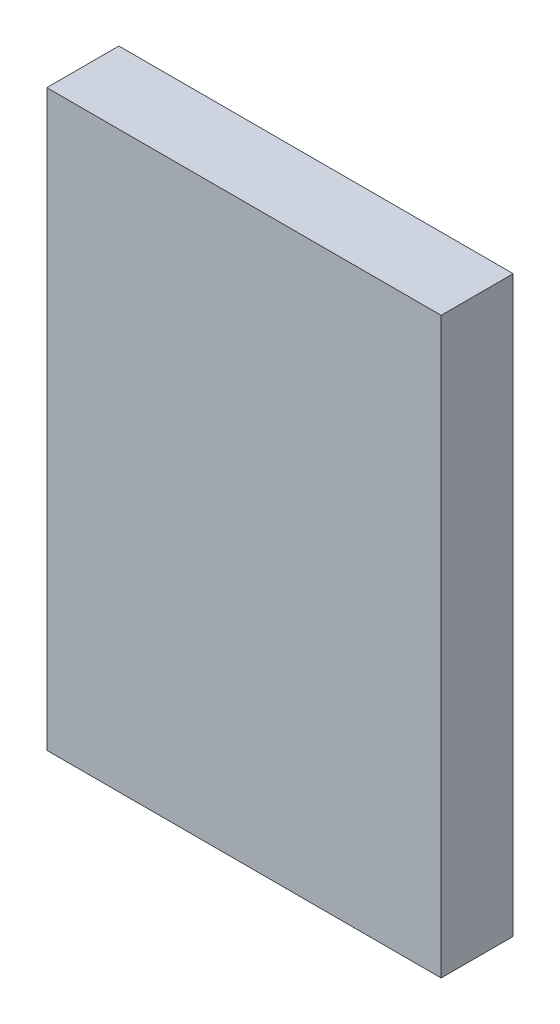
ISO-10303-21;
HEADER;
FILE_DESCRIPTION(('STEP AP214'),'2;1');
FILE_NAME('part.step','',(''),(''),'','','');
FILE_SCHEMA(('AUTOMOTIVE_DESIGN { 1 0 10303 214 1 1 1 1 }'));
ENDSEC;
DATA;
#1=APPLICATION_CONTEXT('core data for automotive mechanical design processes');
#2=APPLICATION_PROTOCOL_DEFINITION('international standard','automotive_design',2000,#1);
#3=PRODUCT_CONTEXT('',#1,'mechanical');
#4=PRODUCT('Part','Part','',(#3));
#5=PRODUCT_RELATED_PRODUCT_CATEGORY('part','',(#4));
#6=PRODUCT_DEFINITION_FORMATION('','',#4);
#7=PRODUCT_DEFINITION_CONTEXT('part definition',#1,'design');
#8=PRODUCT_DEFINITION('design','',#6,#7);
#9=PRODUCT_DEFINITION_SHAPE('','',#8);
#10=(LENGTH_UNIT() NAMED_UNIT(*) SI_UNIT(.MILLI.,.METRE.));
#11=(NAMED_UNIT(*) PLANE_ANGLE_UNIT() SI_UNIT($,.RADIAN.));
#12=(NAMED_UNIT(*) SI_UNIT($,.STERADIAN.) SOLID_ANGLE_UNIT());
#13=UNCERTAINTY_MEASURE_WITH_UNIT(LENGTH_MEASURE(1.E-05),#10,'distance_accuracy_value','');
#14=(GEOMETRIC_REPRESENTATION_CONTEXT(3) GLOBAL_UNCERTAINTY_ASSIGNED_CONTEXT((#13)) GLOBAL_UNIT_ASSIGNED_CONTEXT((#10,
#11,#12)) REPRESENTATION_CONTEXT('',''));
#15=CARTESIAN_POINT('',(0.,0.,0.));
#16=DIRECTION('',(0.,0.,1.));
#17=DIRECTION('',(1.,0.,0.));
#18=AXIS2_PLACEMENT_3D('',#15,#16,#17);
#19=CARTESIAN_POINT('',(-0.597,-1.549,0.));
#20=DIRECTION('',(0.,-1.,0.));
#21=DIRECTION('',(0.,0.,-1.));
#22=AXIS2_PLACEMENT_3D('',#19,#20,#21);
#23=PLANE('',#22);
#24=DIRECTION('',(-1.,0.,0.));
#25=VECTOR('',#24,1.);
#26=CARTESIAN_POINT('',(-0.318,-1.549,0.));
#27=LINE('',#26,#25);
#28=CARTESIAN_POINT('',(-0.318,-1.549,0.));
#29=VERTEX_POINT('',#28);
#30=CARTESIAN_POINT('',(-0.597,-1.549,0.));
#31=VERTEX_POINT('',#30);
#32=EDGE_CURVE('E11',#29,#31,#27,.T.);
#33=ORIENTED_EDGE('',*,*,#32,.F.);
#34=DIRECTION('',(0.,0.,-1.));
#35=VECTOR('',#34,1.);
#36=CARTESIAN_POINT('',(-0.318,-1.549,0.051));
#37=LINE('',#36,#35);
#38=CARTESIAN_POINT('',(-0.318,-1.549,0.051));
#39=VERTEX_POINT('',#38);
#40=EDGE_CURVE('E24',#39,#29,#37,.T.);
#41=ORIENTED_EDGE('',*,*,#40,.F.);
#42=DIRECTION('',(1.,0.,0.));
#43=VECTOR('',#42,1.);
#44=CARTESIAN_POINT('',(-0.597,-1.549,0.051));
#45=LINE('',#44,#43);
#46=CARTESIAN_POINT('',(-0.597,-1.549,0.051));
#47=VERTEX_POINT('',#46);
#48=EDGE_CURVE('E88',#47,#39,#45,.T.);
#49=ORIENTED_EDGE('',*,*,#48,.F.);
#50=DIRECTION('',(0.,0.,1.));
#51=VECTOR('',#50,1.);
#52=CARTESIAN_POINT('',(-0.597,-1.549,0.));
#53=LINE('',#52,#51);
#54=EDGE_CURVE('E77',#31,#47,#53,.T.);
#55=ORIENTED_EDGE('',*,*,#54,.F.);
#56=EDGE_LOOP('',(#33,#41,#49,#55));
#57=FACE_BOUND('',#56,.T.);
#58=ADVANCED_FACE('F17',(#57),#23,.T.);
#59=CARTESIAN_POINT('',(-0.318,-1.549,0.));
#60=DIRECTION('',(1.,0.,0.));
#61=DIRECTION('',(0.,1.,0.));
#62=AXIS2_PLACEMENT_3D('',#59,#60,#61);
#63=PLANE('',#62);
#64=DIRECTION('',(0.,-1.,0.));
#65=VECTOR('',#64,1.);
#66=CARTESIAN_POINT('',(-0.318,-1.143,0.));
#67=LINE('',#66,#65);
#68=CARTESIAN_POINT('',(-0.318,-1.143,0.));
#69=VERTEX_POINT('',#68);
#70=EDGE_CURVE('E85',#69,#29,#67,.T.);
#71=ORIENTED_EDGE('',*,*,#70,.F.);
#72=DIRECTION('',(0.,0.,-1.));
#73=VECTOR('',#72,1.);
#74=CARTESIAN_POINT('',(-0.318,-1.143,0.051));
#75=LINE('',#74,#73);
#76=CARTESIAN_POINT('',(-0.318,-1.143,0.051));
#77=VERTEX_POINT('',#76);
#78=EDGE_CURVE('E83',#77,#69,#75,.T.);
#79=ORIENTED_EDGE('',*,*,#78,.F.);
#80=DIRECTION('',(0.,1.,0.));
#81=VECTOR('',#80,1.);
#82=CARTESIAN_POINT('',(-0.318,-1.549,0.051));
#83=LINE('',#82,#81);
#84=EDGE_CURVE('E72',#39,#77,#83,.T.);
#85=ORIENTED_EDGE('',*,*,#84,.F.);
#86=ORIENTED_EDGE('',*,*,#40,.T.);
#87=EDGE_LOOP('',(#71,#79,#85,#86));
#88=FACE_BOUND('',#87,.T.);
#89=ADVANCED_FACE('F90',(#88),#63,.T.);
#90=CARTESIAN_POINT('',(-0.318,-1.143,0.));
#91=DIRECTION('',(0.,1.,0.));
#92=DIRECTION('',(1.,0.,0.));
#93=AXIS2_PLACEMENT_3D('',#90,#91,#92);
#94=PLANE('',#93);
#95=DIRECTION('',(1.,0.,0.));
#96=VECTOR('',#95,1.);
#97=CARTESIAN_POINT('',(-0.597,-1.143,0.));
#98=LINE('',#97,#96);
#99=CARTESIAN_POINT('',(-0.597,-1.143,0.));
#100=VERTEX_POINT('',#99);
#101=EDGE_CURVE('E60',#100,#69,#98,.T.);
#102=ORIENTED_EDGE('',*,*,#101,.F.);
#103=DIRECTION('',(0.,0.,-1.));
#104=VECTOR('',#103,1.);
#105=CARTESIAN_POINT('',(-0.597,-1.143,0.051));
#106=LINE('',#105,#104);
#107=CARTESIAN_POINT('',(-0.597,-1.143,0.051));
#108=VERTEX_POINT('',#107);
#109=EDGE_CURVE('E54',#108,#100,#106,.T.);
#110=ORIENTED_EDGE('',*,*,#109,.F.);
#111=DIRECTION('',(-1.,0.,0.));
#112=VECTOR('',#111,1.);
#113=CARTESIAN_POINT('',(-0.318,-1.143,0.051));
#114=LINE('',#113,#112);
#115=EDGE_CURVE('E58',#77,#108,#114,.T.);
#116=ORIENTED_EDGE('',*,*,#115,.F.);
#117=ORIENTED_EDGE('',*,*,#78,.T.);
#118=EDGE_LOOP('',(#102,#110,#116,#117));
#119=FACE_BOUND('',#118,.T.);
#120=ADVANCED_FACE('F56',(#119),#94,.T.);
#121=CARTESIAN_POINT('',(-0.597,-1.143,0.));
#122=DIRECTION('',(-1.,0.,0.));
#123=DIRECTION('',(0.,0.,1.));
#124=AXIS2_PLACEMENT_3D('',#121,#122,#123);
#125=PLANE('',#124);
#126=DIRECTION('',(0.,1.,0.));
#127=VECTOR('',#126,1.);
#128=CARTESIAN_POINT('',(-0.597,-1.549,0.));
#129=LINE('',#128,#127);
#130=EDGE_CURVE('E73',#31,#100,#129,.T.);
#131=ORIENTED_EDGE('',*,*,#130,.F.);
#132=ORIENTED_EDGE('',*,*,#54,.T.);
#133=DIRECTION('',(0.,-1.,0.));
#134=VECTOR('',#133,1.);
#135=CARTESIAN_POINT('',(-0.597,-1.143,0.051));
#136=LINE('',#135,#134);
#137=EDGE_CURVE('E70',#108,#47,#136,.T.);
#138=ORIENTED_EDGE('',*,*,#137,.F.);
#139=ORIENTED_EDGE('',*,*,#109,.T.);
#140=EDGE_LOOP('',(#131,#132,#138,#139));
#141=FACE_BOUND('',#140,.T.);
#142=ADVANCED_FACE('F76',(#141),#125,.T.);
#143=CARTESIAN_POINT('',(-0.597,-1.143,0.));
#144=DIRECTION('',(0.,0.,-1.));
#145=DIRECTION('',(0.,-1.,0.));
#146=AXIS2_PLACEMENT_3D('',#143,#144,#145);
#147=PLANE('',#146);
#148=ORIENTED_EDGE('',*,*,#101,.T.);
#149=ORIENTED_EDGE('',*,*,#70,.T.);
#150=ORIENTED_EDGE('',*,*,#32,.T.);
#151=ORIENTED_EDGE('',*,*,#130,.T.);
#152=EDGE_LOOP('',(#148,#149,#150,#151));
#153=FACE_BOUND('',#152,.T.);
#154=ADVANCED_FACE('F91',(#153),#147,.T.);
#155=CARTESIAN_POINT('',(-0.597,-1.549,0.051));
#156=DIRECTION('',(0.,0.,1.));
#157=DIRECTION('',(1.,0.,0.));
#158=AXIS2_PLACEMENT_3D('',#155,#156,#157);
#159=PLANE('',#158);
#160=ORIENTED_EDGE('',*,*,#48,.T.);
#161=ORIENTED_EDGE('',*,*,#84,.T.);
#162=ORIENTED_EDGE('',*,*,#115,.T.);
#163=ORIENTED_EDGE('',*,*,#137,.T.);
#164=EDGE_LOOP('',(#160,#161,#162,#163));
#165=FACE_BOUND('',#164,.T.);
#166=ADVANCED_FACE('F69',(#165),#159,.T.);
#167=CLOSED_SHELL('',(#58,#89,#120,#142,#154,#166));
#168=MANIFOLD_SOLID_BREP('B1',#167);
#169=ADVANCED_BREP_SHAPE_REPRESENTATION('',(#18,#168),#14);
#170=SHAPE_DEFINITION_REPRESENTATION(#9,#169);
ENDSEC;
END-ISO-10303-21;
